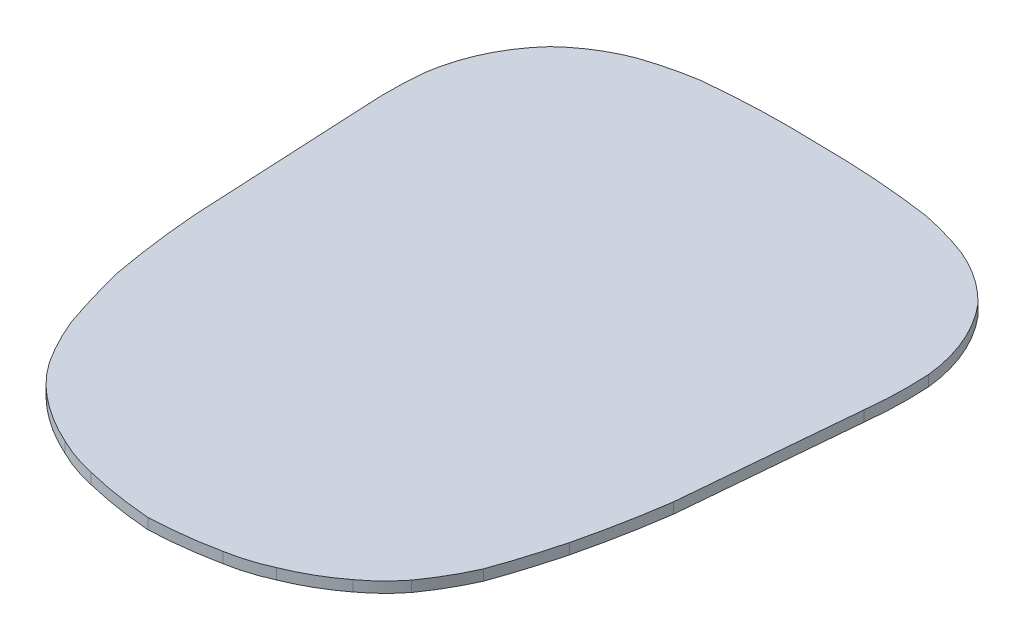
ISO-10303-21;
HEADER;
FILE_DESCRIPTION(('STEP AP214'),'2;1');
FILE_NAME('part.step','',(''),(''),'','','');
FILE_SCHEMA(('AUTOMOTIVE_DESIGN { 1 0 10303 214 1 1 1 1 }'));
ENDSEC;
DATA;
#1=APPLICATION_CONTEXT('core data for automotive mechanical design processes');
#2=APPLICATION_PROTOCOL_DEFINITION('international standard','automotive_design',2000,#1);
#3=PRODUCT_CONTEXT('',#1,'mechanical');
#4=PRODUCT('Part','Part','',(#3));
#5=PRODUCT_RELATED_PRODUCT_CATEGORY('part','',(#4));
#6=PRODUCT_DEFINITION_FORMATION('','',#4);
#7=PRODUCT_DEFINITION_CONTEXT('part definition',#1,'design');
#8=PRODUCT_DEFINITION('design','',#6,#7);
#9=PRODUCT_DEFINITION_SHAPE('','',#8);
#10=(LENGTH_UNIT() NAMED_UNIT(*) SI_UNIT(.MILLI.,.METRE.));
#11=(NAMED_UNIT(*) PLANE_ANGLE_UNIT() SI_UNIT($,.RADIAN.));
#12=(NAMED_UNIT(*) SI_UNIT($,.STERADIAN.) SOLID_ANGLE_UNIT());
#13=UNCERTAINTY_MEASURE_WITH_UNIT(LENGTH_MEASURE(1.E-05),#10,'distance_accuracy_value','');
#14=(GEOMETRIC_REPRESENTATION_CONTEXT(3) GLOBAL_UNCERTAINTY_ASSIGNED_CONTEXT((#13)) GLOBAL_UNIT_ASSIGNED_CONTEXT((#10,
#11,#12)) REPRESENTATION_CONTEXT('',''));
#15=CARTESIAN_POINT('',(0.,0.,0.));
#16=DIRECTION('',(0.,0.,1.));
#17=DIRECTION('',(1.,0.,0.));
#18=AXIS2_PLACEMENT_3D('',#15,#16,#17);
#19=CARTESIAN_POINT('',(-1.57240860866976,2.26760732929248,56.7680888848849));
#20=DIRECTION('',(0.,1.,0.));
#21=DIRECTION('',(1.,0.,0.));
#22=AXIS2_PLACEMENT_3D('',#19,#20,#21);
#23=PLANE('',#22);
#24=CARTESIAN_POINT('',(4.42207857906232,2.26760732929224,26.1060065080088));
#25=DIRECTION('',(0.,-1.,0.));
#26=DIRECTION('',(-1.,0.,0.));
#27=AXIS2_PLACEMENT_3D('',#24,#25,#26);
#28=CIRCLE('',#27,7.3740595978);
#29=CARTESIAN_POINT('',(11.7593440485898,2.26760732929246,25.3702821155991));
#30=VERTEX_POINT('',#29);
#31=CARTESIAN_POINT('',(10.0538039694728,2.26760732929235,21.3457098703074));
#32=VERTEX_POINT('',#31);
#33=EDGE_CURVE('E301',#30,#32,#28,.F.);
#34=ORIENTED_EDGE('',*,*,#33,.F.);
#35=CARTESIAN_POINT('',(-5.02148164229055,2.26760732929194,26.3930993028762));
#36=DIRECTION('',(0.,-1.,0.));
#37=DIRECTION('',(-1.,0.,0.));
#38=AXIS2_PLACEMENT_3D('',#35,#36,#37);
#39=CIRCLE('',#38,16.81196793556);
#40=CARTESIAN_POINT('',(11.6806465076377,2.2676073292925,28.3117397407053));
#41=VERTEX_POINT('',#40);
#42=EDGE_CURVE('E304',#41,#30,#39,.F.);
#43=ORIENTED_EDGE('',*,*,#42,.F.);
#44=DIRECTION('',(-0.0886995040357044,0.,0.996058431008854));
#45=VECTOR('',#44,1.);
#46=CARTESIAN_POINT('',(11.6806465076377,2.26760732929251,28.3117397407053));
#47=LINE('',#46,#45);
#48=CARTESIAN_POINT('',(10.9521530708852,2.26760732929253,36.4924171582455));
#49=VERTEX_POINT('',#48);
#50=EDGE_CURVE('E195',#41,#49,#47,.T.);
#51=ORIENTED_EDGE('',*,*,#50,.T.);
#52=CARTESIAN_POINT('',(-29.9774053404907,2.2676073292912,30.7359674961748));
#53=DIRECTION('',(0.,-1.,0.));
#54=DIRECTION('',(-1.,0.,0.));
#55=AXIS2_PLACEMENT_3D('',#52,#53,#54);
#56=CIRCLE('',#55,41.33237791928);
#57=CARTESIAN_POINT('',(10.168074425755,2.26760732929264,40.5698842540158));
#58=VERTEX_POINT('',#57);
#59=EDGE_CURVE('E20',#58,#49,#56,.F.);
#60=ORIENTED_EDGE('',*,*,#59,.F.);
#61=CARTESIAN_POINT('',(-23.6697185475926,2.26760732929142,31.8539569853536));
#62=DIRECTION('',(0.,-1.,0.));
#63=DIRECTION('',(-1.,0.,0.));
#64=AXIS2_PLACEMENT_3D('',#61,#62,#63);
#65=CIRCLE('',#64,34.94228987144);
#66=CARTESIAN_POINT('',(9.22351885768027,2.26760732929264,43.6437218031987));
#67=VERTEX_POINT('',#66);
#68=EDGE_CURVE('E193',#67,#58,#65,.F.);
#69=ORIENTED_EDGE('',*,*,#68,.F.);
#70=CARTESIAN_POINT('',(-2.27662830007259,2.2676073292922,38.4722908655236));
#71=DIRECTION('',(0.,-1.,0.));
#72=DIRECTION('',(-1.,0.,0.));
#73=AXIS2_PLACEMENT_3D('',#70,#71,#72);
#74=CIRCLE('',#73,12.60940452968);
#75=CARTESIAN_POINT('',(8.00180890675191,2.26760732929263,45.7764548271608));
#76=VERTEX_POINT('',#75);
#77=EDGE_CURVE('E206',#76,#67,#74,.F.);
#78=ORIENTED_EDGE('',*,*,#77,.F.);
#79=CARTESIAN_POINT('',(2.40671094314183,2.26760732929239,41.4066557836026));
#80=DIRECTION('',(0.,-1.,0.));
#81=DIRECTION('',(-1.,0.,0.));
#82=AXIS2_PLACEMENT_3D('',#79,#80,#81);
#83=CIRCLE('',#82,7.09931439672);
#84=CARTESIAN_POINT('',(6.60488205735902,2.26760732929261,47.1316557136662));
#85=VERTEX_POINT('',#84);
#86=EDGE_CURVE('E224',#85,#76,#83,.F.);
#87=ORIENTED_EDGE('',*,*,#86,.F.);
#88=CARTESIAN_POINT('',(0.665319016808594,2.26760732929231,39.3768483498174));
#89=DIRECTION('',(0.,-1.,0.));
#90=DIRECTION('',(-1.,0.,0.));
#91=AXIS2_PLACEMENT_3D('',#88,#89,#90);
#92=CIRCLE('',#91,9.76808304444);
#93=CARTESIAN_POINT('',(4.32729672971727,2.26760732929255,48.4325297484332));
#94=VERTEX_POINT('',#93);
#95=EDGE_CURVE('E227',#94,#85,#92,.F.);
#96=ORIENTED_EDGE('',*,*,#95,.F.);
#97=CARTESIAN_POINT('',(1.0962715162023,2.26760732929235,41.3746398254039));
#98=DIRECTION('',(0.,-1.,0.));
#99=DIRECTION('',(-1.,0.,0.));
#100=AXIS2_PLACEMENT_3D('',#97,#98,#99);
#101=CIRCLE('',#100,7.76230211316);
#102=CARTESIAN_POINT('',(2.4216958973115,2.2676073292925,49.0229458016269));
#103=VERTEX_POINT('',#102);
#104=EDGE_CURVE('E231',#103,#94,#101,.F.);
#105=ORIENTED_EDGE('',*,*,#104,.F.);
#106=CARTESIAN_POINT('',(-1.50562705310546,2.2676073292921,29.7823019466604));
#107=DIRECTION('',(0.,-1.,0.));
#108=DIRECTION('',(-1.,0.,0.));
#109=AXIS2_PLACEMENT_3D('',#106,#107,#108);
#110=CIRCLE('',#109,19.6373684976);
#111=CARTESIAN_POINT('',(-0.711226246908648,2.2676073292924,49.403595708022));
#112=VERTEX_POINT('',#111);
#113=EDGE_CURVE('E235',#112,#103,#110,.F.);
#114=ORIENTED_EDGE('',*,*,#113,.F.);
#115=CARTESIAN_POINT('',(0.780834496719865,2.26760732929217,29.8233057086877));
#116=DIRECTION('',(0.,-1.,0.));
#117=DIRECTION('',(-1.,0.,0.));
#118=AXIS2_PLACEMENT_3D('',#115,#116,#117);
#119=CIRCLE('',#118,19.63705684976);
#120=CARTESIAN_POINT('',(-3.87229574569521,2.2676073292923,48.9011038171653));
#121=VERTEX_POINT('',#120);
#122=EDGE_CURVE('E239',#121,#112,#119,.F.);
#123=ORIENTED_EDGE('',*,*,#122,.F.);
#124=CARTESIAN_POINT('',(-2.25185647870508,2.26760732929224,41.3098252240715));
#125=DIRECTION('',(0.,-1.,0.));
#126=DIRECTION('',(-1.,0.,0.));
#127=AXIS2_PLACEMENT_3D('',#124,#125,#126);
#128=CIRCLE('',#127,7.76230211316);
#129=CARTESIAN_POINT('',(-5.75361833776036,2.26760732929224,48.2373787589374));
#130=VERTEX_POINT('',#129);
#131=EDGE_CURVE('E243',#130,#121,#128,.F.);
#132=ORIENTED_EDGE('',*,*,#131,.F.);
#133=CARTESIAN_POINT('',(-1.74390750050726,2.26760732929222,39.3302094350337));
#134=DIRECTION('',(0.,-1.,0.));
#135=DIRECTION('',(-1.,0.,0.));
#136=AXIS2_PLACEMENT_3D('',#133,#134,#135);
#137=CIRCLE('',#136,9.76808304444);
#138=CARTESIAN_POINT('',(-7.97915028682764,2.26760732929213,46.8493313092099));
#139=VERTEX_POINT('',#138);
#140=EDGE_CURVE('E247',#139,#130,#137,.F.);
#141=ORIENTED_EDGE('',*,*,#140,.F.);
#142=CARTESIAN_POINT('',(-3.45763258069546,2.2676073292922,41.3761108188031));
#143=DIRECTION('',(0.,-1.,0.));
#144=DIRECTION('',(-1.,0.,0.));
#145=AXIS2_PLACEMENT_3D('',#142,#143,#144);
#146=CIRCLE('',#145,7.09931439672);
#147=CARTESIAN_POINT('',(-9.27735431255493,2.26760732929207,45.4419568398913));
#148=VERTEX_POINT('',#147);
#149=EDGE_CURVE('E251',#148,#139,#146,.F.);
#150=ORIENTED_EDGE('',*,*,#149,.F.);
#151=CARTESIAN_POINT('',(1.27607088396156,2.26760732929232,38.5410656500054));
#152=DIRECTION('',(0.,-1.,0.));
#153=DIRECTION('',(-1.,0.,0.));
#154=AXIS2_PLACEMENT_3D('',#151,#152,#153);
#155=CIRCLE('',#154,12.60940452968);
#156=CARTESIAN_POINT('',(-10.4156070143635,2.26760732929201,43.2635385736895));
#157=VERTEX_POINT('',#156);
#158=EDGE_CURVE('E255',#157,#148,#155,.F.);
#159=ORIENTED_EDGE('',*,*,#158,.F.);
#160=CARTESIAN_POINT('',(22.6114523086671,2.2676073292929,31.8540261418302));
#161=DIRECTION('',(0.,-1.,0.));
#162=DIRECTION('',(-1.,0.,0.));
#163=AXIS2_PLACEMENT_3D('',#160,#161,#162);
#164=CIRCLE('',#163,34.94228987144);
#165=CARTESIAN_POINT('',(-11.3308378537232,2.26760732929193,40.1536984240255));
#166=VERTEX_POINT('',#165);
#167=EDGE_CURVE('E259',#166,#157,#164,.F.);
#168=ORIENTED_EDGE('',*,*,#167,.F.);
#169=CARTESIAN_POINT('',(29.3351155793448,2.26760732929313,32.7614257124888));
#170=DIRECTION('',(0.,-1.,0.));
#171=DIRECTION('',(-1.,0.,0.));
#172=AXIS2_PLACEMENT_3D('',#169,#170,#171);
#173=CIRCLE('',#172,41.33237791928);
#174=CARTESIAN_POINT('',(-11.8661733347099,2.26760732929185,36.0506895028808));
#175=VERTEX_POINT('',#174);
#176=EDGE_CURVE('E263',#175,#166,#173,.F.);
#177=ORIENTED_EDGE('',*,*,#176,.F.);
#178=DIRECTION('',(-0.0500831809567765,0.,-0.998745050042928));
#179=VECTOR('',#178,1.);
#180=CARTESIAN_POINT('',(-11.8661733347099,2.26760732929186,36.0506895028803));
#181=LINE('',#180,#179);
#182=CARTESIAN_POINT('',(-12.2775089900255,2.2676073292918,27.8479467496358));
#183=VERTEX_POINT('',#182);
#184=EDGE_CURVE('E271',#175,#183,#181,.T.);
#185=ORIENTED_EDGE('',*,*,#184,.T.);
#186=CARTESIAN_POINT('',(4.48636162568622,2.26760732929224,26.5771565049552));
#187=DIRECTION('',(0.,-1.,0.));
#188=DIRECTION('',(-1.,0.,0.));
#189=AXIS2_PLACEMENT_3D('',#186,#187,#188);
#190=CIRCLE('',#189,16.81196793556);
#191=CARTESIAN_POINT('',(-12.2423060527561,2.26760732929168,24.9056471359908));
#192=VERTEX_POINT('',#191);
#193=EDGE_CURVE('E267',#192,#183,#190,.F.);
#194=ORIENTED_EDGE('',*,*,#193,.F.);
#195=CARTESIAN_POINT('',(-4.93901211459901,2.26760732929193,25.9247902097462));
#196=DIRECTION('',(0.,-1.,0.));
#197=DIRECTION('',(-1.,0.,0.));
#198=AXIS2_PLACEMENT_3D('',#195,#196,#197);
#199=CIRCLE('',#198,7.3740595978);
#200=CARTESIAN_POINT('',(-10.3822831278822,2.26760732929168,20.9500986989229));
#201=VERTEX_POINT('',#200);
#202=EDGE_CURVE('E273',#201,#192,#199,.F.);
#203=ORIENTED_EDGE('',*,*,#202,.F.);
#204=CARTESIAN_POINT('',(-5.24273193998348,2.26760732929193,26.3246247690595));
#205=DIRECTION('',(0.,-1.,0.));
#206=DIRECTION('',(-1.,0.,0.));
#207=AXIS2_PLACEMENT_3D('',#204,#205,#206);
#208=CIRCLE('',#207,7.43643173112);
#209=CARTESIAN_POINT('',(-7.86404338634419,2.26760732929175,19.3655125273445));
#210=VERTEX_POINT('',#209);
#211=EDGE_CURVE('E277',#210,#201,#208,.F.);
#212=ORIENTED_EDGE('',*,*,#211,.F.);
#213=CARTESIAN_POINT('',(-3.13266364538468,2.2676073292921,33.5130256945662));
#214=DIRECTION('',(0.,-1.,0.));
#215=DIRECTION('',(-1.,0.,0.));
#216=AXIS2_PLACEMENT_3D('',#213,#214,#215);
#217=CIRCLE('',#216,14.91771038296);
#218=CARTESIAN_POINT('',(-5.49599442515238,2.26760732929182,18.7837096651209));
#219=VERTEX_POINT('',#218);
#220=EDGE_CURVE('E281',#219,#210,#217,.F.);
#221=ORIENTED_EDGE('',*,*,#220,.F.);
#222=CARTESIAN_POINT('',(-1.57240860866976,2.26760732929248,56.7680888848849));
#223=DIRECTION('',(0.,-1.,0.));
#224=DIRECTION('',(-1.,0.,0.));
#225=AXIS2_PLACEMENT_3D('',#222,#223,#224);
#226=CIRCLE('',#225,38.18648439396);
#227=CARTESIAN_POINT('',(-0.115098477137718,2.26760732929199,18.6094222736066));
#228=VERTEX_POINT('',#227);
#229=EDGE_CURVE('E285',#228,#219,#226,.F.);
#230=ORIENTED_EDGE('',*,*,#229,.F.);
#231=CARTESIAN_POINT('',(-0.135712780641645,2.26760732929253,56.7959011448422));
#232=DIRECTION('',(0.,-1.,0.));
#233=DIRECTION('',(-1.,0.,0.));
#234=AXIS2_PLACEMENT_3D('',#231,#232,#233);
#235=CIRCLE('',#234,38.186484435371);
#236=CARTESIAN_POINT('',(5.25502065738708,2.26760732929216,18.9918327588477));
#237=VERTEX_POINT('',#236);
#238=EDGE_CURVE('E289',#237,#228,#235,.F.);
#239=ORIENTED_EDGE('',*,*,#238,.F.);
#240=CARTESIAN_POINT('',(2.32340041465556,2.26760732929227,33.6186466915632));
#241=DIRECTION('',(0.,-1.,0.));
#242=DIRECTION('',(-1.,0.,0.));
#243=AXIS2_PLACEMENT_3D('',#240,#241,#242);
#244=CIRCLE('',#243,14.91771038296);
#245=CARTESIAN_POINT('',(7.59877825453707,2.26760732929225,19.6648489391103));
#246=VERTEX_POINT('',#245);
#247=EDGE_CURVE('E293',#246,#237,#244,.F.);
#248=ORIENTED_EDGE('',*,*,#247,.F.);
#249=CARTESIAN_POINT('',(4.71009628830584,2.26760732929225,26.5172961946227));
#250=DIRECTION('',(0.,-1.,0.));
#251=DIRECTION('',(-1.,0.,0.));
#252=AXIS2_PLACEMENT_3D('',#249,#250,#251);
#253=CIRCLE('',#252,7.43643173111999);
#254=EDGE_CURVE('E297',#32,#246,#253,.F.);
#255=ORIENTED_EDGE('',*,*,#254,.F.);
#256=EDGE_LOOP('',(#34,#43,#51,#60,#69,#78,#87,#96,#105,#114,#123,#132,#141,#150,#159,#168,#177,
#185,#194,#203,#212,#221,#230,#239,#248,#255));
#257=FACE_BOUND('',#256,.T.);
#258=ADVANCED_FACE('F17',(#257),#23,.F.);
#259=CARTESIAN_POINT('',(-29.9774053404907,2.6486073292912,30.7359674961748));
#260=DIRECTION('',(0.,-1.,0.));
#261=DIRECTION('',(-1.,0.,0.));
#262=AXIS2_PLACEMENT_3D('',#259,#260,#261);
#263=CYLINDRICAL_SURFACE('',#262,41.33237791928);
#264=DIRECTION('',(0.,-1.,0.));
#265=VECTOR('',#264,1.);
#266=CARTESIAN_POINT('',(10.1680744257549,2.64860732929262,40.5698842540162));
#267=LINE('',#266,#265);
#268=CARTESIAN_POINT('',(10.1680744257549,2.76860732929264,40.5698842540159));
#269=VERTEX_POINT('',#268);
#270=EDGE_CURVE('E200',#58,#269,#267,.F.);
#271=ORIENTED_EDGE('',*,*,#270,.F.);
#272=ORIENTED_EDGE('',*,*,#59,.T.);
#273=DIRECTION('',(0.,1.,0.));
#274=VECTOR('',#273,1.);
#275=CARTESIAN_POINT('',(10.9521530708852,2.6486073292925,36.4924171582455));
#276=LINE('',#275,#274);
#277=CARTESIAN_POINT('',(10.9521530708852,2.76860732929259,36.4924171582455));
#278=VERTEX_POINT('',#277);
#279=EDGE_CURVE('E314',#49,#278,#276,.T.);
#280=ORIENTED_EDGE('',*,*,#279,.T.);
#281=CARTESIAN_POINT('',(-29.9774053404907,2.76860732929121,30.7359674961748));
#282=DIRECTION('',(0.,-1.,0.));
#283=DIRECTION('',(-1.,0.,0.));
#284=AXIS2_PLACEMENT_3D('',#281,#282,#283);
#285=CIRCLE('',#284,41.33237791928);
#286=EDGE_CURVE('E203',#269,#278,#285,.F.);
#287=ORIENTED_EDGE('',*,*,#286,.F.);
#288=EDGE_LOOP('',(#271,#272,#280,#287));
#289=FACE_BOUND('',#288,.T.);
#290=ADVANCED_FACE('F201',(#289),#263,.T.);
#291=CARTESIAN_POINT('',(11.6806465076376,2.6486073292925,28.3117397407053));
#292=DIRECTION('',(-0.996058431008854,0.,-0.0886995040357044));
#293=DIRECTION('',(-0.0886995040357044,0.,0.996058431008854));
#294=AXIS2_PLACEMENT_3D('',#291,#292,#293);
#295=PLANE('',#294);
#296=ORIENTED_EDGE('',*,*,#50,.F.);
#297=DIRECTION('',(0.,-1.,0.));
#298=VECTOR('',#297,1.);
#299=CARTESIAN_POINT('',(11.6806465076377,2.6486073292925,28.3117397407053));
#300=LINE('',#299,#298);
#301=CARTESIAN_POINT('',(11.6806465076376,2.76860732929251,28.3117397407053));
#302=VERTEX_POINT('',#301);
#303=EDGE_CURVE('E306',#302,#41,#300,.T.);
#304=ORIENTED_EDGE('',*,*,#303,.F.);
#305=DIRECTION('',(0.088699504035705,0.,-0.996058431008854));
#306=VECTOR('',#305,1.);
#307=CARTESIAN_POINT('',(10.9521530708852,2.7686073292926,36.4924171582455));
#308=LINE('',#307,#306);
#309=EDGE_CURVE('E215',#278,#302,#308,.T.);
#310=ORIENTED_EDGE('',*,*,#309,.F.);
#311=ORIENTED_EDGE('',*,*,#279,.F.);
#312=EDGE_LOOP('',(#296,#304,#310,#311));
#313=FACE_BOUND('',#312,.T.);
#314=ADVANCED_FACE('F583',(#313),#295,.F.);
#315=CARTESIAN_POINT('',(-5.02148164229056,2.64860732929194,26.3930993028762));
#316=DIRECTION('',(0.,-1.,0.));
#317=DIRECTION('',(-1.,0.,0.));
#318=AXIS2_PLACEMENT_3D('',#315,#316,#317);
#319=CYLINDRICAL_SURFACE('',#318,16.81196793556);
#320=ORIENTED_EDGE('',*,*,#303,.T.);
#321=ORIENTED_EDGE('',*,*,#42,.T.);
#322=DIRECTION('',(0.,-1.,0.));
#323=VECTOR('',#322,1.);
#324=CARTESIAN_POINT('',(11.7593440485897,2.64860732929246,25.3702821155991));
#325=LINE('',#324,#323);
#326=CARTESIAN_POINT('',(11.7593440485897,2.76860732929247,25.3702821155991));
#327=VERTEX_POINT('',#326);
#328=EDGE_CURVE('E303',#327,#30,#325,.T.);
#329=ORIENTED_EDGE('',*,*,#328,.F.);
#330=CARTESIAN_POINT('',(-5.02148164229056,2.76860732929194,26.3930993028762));
#331=DIRECTION('',(0.,-1.,0.));
#332=DIRECTION('',(-1.,0.,0.));
#333=AXIS2_PLACEMENT_3D('',#330,#331,#332);
#334=CIRCLE('',#333,16.81196793556);
#335=EDGE_CURVE('E407',#302,#327,#334,.F.);
#336=ORIENTED_EDGE('',*,*,#335,.F.);
#337=EDGE_LOOP('',(#320,#321,#329,#336));
#338=FACE_BOUND('',#337,.T.);
#339=ADVANCED_FACE('F580',(#338),#319,.T.);
#340=CARTESIAN_POINT('',(4.42207857906231,2.64860732929223,26.1060065080088));
#341=DIRECTION('',(0.,-1.,0.));
#342=DIRECTION('',(-1.,0.,0.));
#343=AXIS2_PLACEMENT_3D('',#340,#341,#342);
#344=CYLINDRICAL_SURFACE('',#343,7.3740595978);
#345=ORIENTED_EDGE('',*,*,#328,.T.);
#346=ORIENTED_EDGE('',*,*,#33,.T.);
#347=DIRECTION('',(0.,-1.,0.));
#348=VECTOR('',#347,1.);
#349=CARTESIAN_POINT('',(10.0538039694728,2.64860732929235,21.3457098703074));
#350=LINE('',#349,#348);
#351=CARTESIAN_POINT('',(10.0538039694728,2.76860732929237,21.3457098703074));
#352=VERTEX_POINT('',#351);
#353=EDGE_CURVE('E300',#352,#32,#350,.T.);
#354=ORIENTED_EDGE('',*,*,#353,.F.);
#355=CARTESIAN_POINT('',(4.42207857906231,2.76860732929225,26.1060065080088));
#356=DIRECTION('',(0.,-1.,0.));
#357=DIRECTION('',(-1.,0.,0.));
#358=AXIS2_PLACEMENT_3D('',#355,#356,#357);
#359=CIRCLE('',#358,7.3740595978);
#360=EDGE_CURVE('E404',#327,#352,#359,.F.);
#361=ORIENTED_EDGE('',*,*,#360,.F.);
#362=EDGE_LOOP('',(#345,#346,#354,#361));
#363=FACE_BOUND('',#362,.T.);
#364=ADVANCED_FACE('F484',(#363),#344,.T.);
#365=CARTESIAN_POINT('',(4.71009628830582,2.64860732929225,26.5172961946227));
#366=DIRECTION('',(0.,-1.,0.));
#367=DIRECTION('',(-1.,0.,0.));
#368=AXIS2_PLACEMENT_3D('',#365,#366,#367);
#369=CYLINDRICAL_SURFACE('',#368,7.43643173111999);
#370=ORIENTED_EDGE('',*,*,#353,.T.);
#371=ORIENTED_EDGE('',*,*,#254,.T.);
#372=DIRECTION('',(0.,-1.,0.));
#373=VECTOR('',#372,1.);
#374=CARTESIAN_POINT('',(7.59877825453708,2.64860732929225,19.6648489391103));
#375=LINE('',#374,#373);
#376=CARTESIAN_POINT('',(7.59877825453705,2.76860732929226,19.6648489391103));
#377=VERTEX_POINT('',#376);
#378=EDGE_CURVE('E296',#377,#246,#375,.T.);
#379=ORIENTED_EDGE('',*,*,#378,.F.);
#380=CARTESIAN_POINT('',(4.71009628830582,2.76860732929226,26.5172961946227));
#381=DIRECTION('',(0.,-1.,0.));
#382=DIRECTION('',(-1.,0.,0.));
#383=AXIS2_PLACEMENT_3D('',#380,#381,#382);
#384=CIRCLE('',#383,7.43643173111999);
#385=EDGE_CURVE('E400',#352,#377,#384,.F.);
#386=ORIENTED_EDGE('',*,*,#385,.F.);
#387=EDGE_LOOP('',(#370,#371,#379,#386));
#388=FACE_BOUND('',#387,.T.);
#389=ADVANCED_FACE('F479',(#388),#369,.T.);
#390=CARTESIAN_POINT('',(2.32340041465555,2.64860732929228,33.6186466915632));
#391=DIRECTION('',(0.,-1.,0.));
#392=DIRECTION('',(-1.,0.,0.));
#393=AXIS2_PLACEMENT_3D('',#390,#391,#392);
#394=CYLINDRICAL_SURFACE('',#393,14.91771038296);
#395=ORIENTED_EDGE('',*,*,#378,.T.);
#396=ORIENTED_EDGE('',*,*,#247,.T.);
#397=DIRECTION('',(0.,-1.,0.));
#398=VECTOR('',#397,1.);
#399=CARTESIAN_POINT('',(5.25502065738701,2.64860732929216,18.9918327588477));
#400=LINE('',#399,#398);
#401=CARTESIAN_POINT('',(5.25502065738708,2.76860732929217,18.9918327588477));
#402=VERTEX_POINT('',#401);
#403=EDGE_CURVE('E292',#402,#237,#400,.T.);
#404=ORIENTED_EDGE('',*,*,#403,.F.);
#405=CARTESIAN_POINT('',(2.32340041465554,2.76860732929228,33.6186466915632));
#406=DIRECTION('',(0.,-1.,0.));
#407=DIRECTION('',(-1.,0.,0.));
#408=AXIS2_PLACEMENT_3D('',#405,#406,#407);
#409=CIRCLE('',#408,14.91771038296);
#410=EDGE_CURVE('E396',#377,#402,#409,.F.);
#411=ORIENTED_EDGE('',*,*,#410,.F.);
#412=EDGE_LOOP('',(#395,#396,#404,#411));
#413=FACE_BOUND('',#412,.T.);
#414=ADVANCED_FACE('F489',(#413),#394,.T.);
#415=CARTESIAN_POINT('',(-0.135712780641657,2.64860732929253,56.7959011448422));
#416=DIRECTION('',(0.,-1.,0.));
#417=DIRECTION('',(-1.,0.,0.));
#418=AXIS2_PLACEMENT_3D('',#415,#416,#417);
#419=CYLINDRICAL_SURFACE('',#418,38.186484435371);
#420=ORIENTED_EDGE('',*,*,#403,.T.);
#421=ORIENTED_EDGE('',*,*,#238,.T.);
#422=DIRECTION('',(0.,-1.,0.));
#423=VECTOR('',#422,1.);
#424=CARTESIAN_POINT('',(-0.115098477137699,2.648607329292,18.6094222736066));
#425=LINE('',#424,#423);
#426=CARTESIAN_POINT('',(-0.115098477137734,2.76860732929199,18.6094222736066));
#427=VERTEX_POINT('',#426);
#428=EDGE_CURVE('E288',#427,#228,#425,.T.);
#429=ORIENTED_EDGE('',*,*,#428,.F.);
#430=CARTESIAN_POINT('',(-0.135712780641661,2.76860732929253,56.7959011448422));
#431=DIRECTION('',(0.,-1.,0.));
#432=DIRECTION('',(-1.,0.,0.));
#433=AXIS2_PLACEMENT_3D('',#430,#431,#432);
#434=CIRCLE('',#433,38.186484435371);
#435=EDGE_CURVE('E392',#402,#427,#434,.F.);
#436=ORIENTED_EDGE('',*,*,#435,.F.);
#437=EDGE_LOOP('',(#420,#421,#429,#436));
#438=FACE_BOUND('',#437,.T.);
#439=ADVANCED_FACE('F569',(#438),#419,.T.);
#440=CARTESIAN_POINT('',(-1.57240860866977,2.64860732929248,56.7680888848849));
#441=DIRECTION('',(0.,-1.,0.));
#442=DIRECTION('',(-1.,0.,0.));
#443=AXIS2_PLACEMENT_3D('',#440,#441,#442);
#444=CYLINDRICAL_SURFACE('',#443,38.18648439396);
#445=ORIENTED_EDGE('',*,*,#428,.T.);
#446=ORIENTED_EDGE('',*,*,#229,.T.);
#447=DIRECTION('',(0.,-1.,0.));
#448=VECTOR('',#447,1.);
#449=CARTESIAN_POINT('',(-5.49599442515232,2.64860732929181,18.7837096651209));
#450=LINE('',#449,#448);
#451=CARTESIAN_POINT('',(-5.49599442515241,2.76860732929182,18.7837096651209));
#452=VERTEX_POINT('',#451);
#453=EDGE_CURVE('E284',#452,#219,#450,.T.);
#454=ORIENTED_EDGE('',*,*,#453,.F.);
#455=CARTESIAN_POINT('',(-1.57240860866978,2.76860732929248,56.7680888848849));
#456=DIRECTION('',(0.,-1.,0.));
#457=DIRECTION('',(-1.,0.,0.));
#458=AXIS2_PLACEMENT_3D('',#455,#456,#457);
#459=CIRCLE('',#458,38.18648439396);
#460=EDGE_CURVE('E388',#427,#452,#459,.F.);
#461=ORIENTED_EDGE('',*,*,#460,.F.);
#462=EDGE_LOOP('',(#445,#446,#454,#461));
#463=FACE_BOUND('',#462,.T.);
#464=ADVANCED_FACE('F565',(#463),#444,.T.);
#465=CARTESIAN_POINT('',(-3.13266364538469,2.6486073292921,33.5130256945662));
#466=DIRECTION('',(0.,-1.,0.));
#467=DIRECTION('',(-1.,0.,0.));
#468=AXIS2_PLACEMENT_3D('',#465,#466,#467);
#469=CYLINDRICAL_SURFACE('',#468,14.91771038296);
#470=ORIENTED_EDGE('',*,*,#453,.T.);
#471=ORIENTED_EDGE('',*,*,#220,.T.);
#472=DIRECTION('',(0.,-1.,0.));
#473=VECTOR('',#472,1.);
#474=CARTESIAN_POINT('',(-7.86404338634418,2.64860732929175,19.3655125273445));
#475=LINE('',#474,#473);
#476=CARTESIAN_POINT('',(-7.86404338634421,2.76860732929176,19.3655125273445));
#477=VERTEX_POINT('',#476);
#478=EDGE_CURVE('E280',#477,#210,#475,.T.);
#479=ORIENTED_EDGE('',*,*,#478,.F.);
#480=CARTESIAN_POINT('',(-3.13266364538469,2.7686073292921,33.5130256945662));
#481=DIRECTION('',(0.,-1.,0.));
#482=DIRECTION('',(-1.,0.,0.));
#483=AXIS2_PLACEMENT_3D('',#480,#481,#482);
#484=CIRCLE('',#483,14.91771038296);
#485=EDGE_CURVE('E384',#452,#477,#484,.F.);
#486=ORIENTED_EDGE('',*,*,#485,.F.);
#487=EDGE_LOOP('',(#470,#471,#479,#486));
#488=FACE_BOUND('',#487,.T.);
#489=ADVANCED_FACE('F561',(#488),#469,.T.);
#490=CARTESIAN_POINT('',(-5.2427319399835,2.64860732929193,26.3246247690595));
#491=DIRECTION('',(0.,-1.,0.));
#492=DIRECTION('',(-1.,0.,0.));
#493=AXIS2_PLACEMENT_3D('',#490,#491,#492);
#494=CYLINDRICAL_SURFACE('',#493,7.43643173112);
#495=ORIENTED_EDGE('',*,*,#478,.T.);
#496=ORIENTED_EDGE('',*,*,#211,.T.);
#497=DIRECTION('',(0.,-1.,0.));
#498=VECTOR('',#497,1.);
#499=CARTESIAN_POINT('',(-10.3822831278822,2.64860732929169,20.9500986989229));
#500=LINE('',#499,#498);
#501=CARTESIAN_POINT('',(-10.3822831278822,2.7686073292917,20.9500986989229));
#502=VERTEX_POINT('',#501);
#503=EDGE_CURVE('E276',#502,#201,#500,.T.);
#504=ORIENTED_EDGE('',*,*,#503,.F.);
#505=CARTESIAN_POINT('',(-5.2427319399835,2.76860732929193,26.3246247690595));
#506=DIRECTION('',(0.,-1.,0.));
#507=DIRECTION('',(-1.,0.,0.));
#508=AXIS2_PLACEMENT_3D('',#505,#506,#507);
#509=CIRCLE('',#508,7.43643173112);
#510=EDGE_CURVE('E380',#477,#502,#509,.F.);
#511=ORIENTED_EDGE('',*,*,#510,.F.);
#512=EDGE_LOOP('',(#495,#496,#504,#511));
#513=FACE_BOUND('',#512,.T.);
#514=ADVANCED_FACE('F557',(#513),#494,.T.);
#515=CARTESIAN_POINT('',(-4.93901211459902,2.64860732929193,25.9247902097462));
#516=DIRECTION('',(0.,-1.,0.));
#517=DIRECTION('',(-1.,0.,0.));
#518=AXIS2_PLACEMENT_3D('',#515,#516,#517);
#519=CYLINDRICAL_SURFACE('',#518,7.3740595978);
#520=ORIENTED_EDGE('',*,*,#503,.T.);
#521=ORIENTED_EDGE('',*,*,#202,.T.);
#522=DIRECTION('',(0.,-1.,0.));
#523=VECTOR('',#522,1.);
#524=CARTESIAN_POINT('',(-12.2423060527561,2.64860732929169,24.9056471359908));
#525=LINE('',#524,#523);
#526=CARTESIAN_POINT('',(-12.2423060527562,2.7686073292917,24.9056471359908));
#527=VERTEX_POINT('',#526);
#528=EDGE_CURVE('E272',#527,#192,#525,.T.);
#529=ORIENTED_EDGE('',*,*,#528,.F.);
#530=CARTESIAN_POINT('',(-4.93901211459903,2.76860732929194,25.9247902097462));
#531=DIRECTION('',(0.,-1.,0.));
#532=DIRECTION('',(-1.,0.,0.));
#533=AXIS2_PLACEMENT_3D('',#530,#531,#532);
#534=CIRCLE('',#533,7.3740595978);
#535=EDGE_CURVE('E376',#502,#527,#534,.F.);
#536=ORIENTED_EDGE('',*,*,#535,.F.);
#537=EDGE_LOOP('',(#520,#521,#529,#536));
#538=FACE_BOUND('',#537,.T.);
#539=ADVANCED_FACE('F553',(#538),#519,.T.);
#540=CARTESIAN_POINT('',(4.4863616256862,2.64860732929224,26.5771565049552));
#541=DIRECTION('',(0.,-1.,0.));
#542=DIRECTION('',(-1.,0.,0.));
#543=AXIS2_PLACEMENT_3D('',#540,#541,#542);
#544=CYLINDRICAL_SURFACE('',#543,16.81196793556);
#545=ORIENTED_EDGE('',*,*,#528,.T.);
#546=ORIENTED_EDGE('',*,*,#193,.T.);
#547=DIRECTION('',(0.,1.,0.));
#548=VECTOR('',#547,1.);
#549=CARTESIAN_POINT('',(-12.2775089900255,2.64860732929185,27.8479467496357));
#550=LINE('',#549,#548);
#551=CARTESIAN_POINT('',(-12.2775089900255,2.76860732929173,27.8479467496358));
#552=VERTEX_POINT('',#551);
#553=EDGE_CURVE('E323',#183,#552,#550,.T.);
#554=ORIENTED_EDGE('',*,*,#553,.T.);
#555=CARTESIAN_POINT('',(4.4863616256862,2.76860732929224,26.5771565049552));
#556=DIRECTION('',(0.,-1.,0.));
#557=DIRECTION('',(-1.,0.,0.));
#558=AXIS2_PLACEMENT_3D('',#555,#556,#557);
#559=CIRCLE('',#558,16.81196793556);
#560=EDGE_CURVE('E372',#527,#552,#559,.F.);
#561=ORIENTED_EDGE('',*,*,#560,.F.);
#562=EDGE_LOOP('',(#545,#546,#554,#561));
#563=FACE_BOUND('',#562,.T.);
#564=ADVANCED_FACE('F549',(#563),#544,.T.);
#565=CARTESIAN_POINT('',(-11.8661733347099,2.64860732929185,36.0506895028803));
#566=DIRECTION('',(0.998745050042928,0.,-0.0500831809567765));
#567=DIRECTION('',(-0.0500831809567765,0.,-0.998745050042928));
#568=AXIS2_PLACEMENT_3D('',#565,#566,#567);
#569=PLANE('',#568);
#570=ORIENTED_EDGE('',*,*,#184,.F.);
#571=DIRECTION('',(0.,-1.,0.));
#572=VECTOR('',#571,1.);
#573=CARTESIAN_POINT('',(-11.8661733347099,2.64860732929185,36.0506895028805));
#574=LINE('',#573,#572);
#575=CARTESIAN_POINT('',(-11.8661733347099,2.76860732929187,36.0506895028806));
#576=VERTEX_POINT('',#575);
#577=EDGE_CURVE('E266',#576,#175,#574,.T.);
#578=ORIENTED_EDGE('',*,*,#577,.F.);
#579=DIRECTION('',(0.0500831809567763,0.,0.998745050042928));
#580=VECTOR('',#579,1.);
#581=CARTESIAN_POINT('',(-12.2775089900255,2.76860732929173,27.8479467496357));
#582=LINE('',#581,#580);
#583=EDGE_CURVE('E371',#552,#576,#582,.T.);
#584=ORIENTED_EDGE('',*,*,#583,.F.);
#585=ORIENTED_EDGE('',*,*,#553,.F.);
#586=EDGE_LOOP('',(#570,#578,#584,#585));
#587=FACE_BOUND('',#586,.T.);
#588=ADVANCED_FACE('F545',(#587),#569,.F.);
#589=CARTESIAN_POINT('',(29.3351155793448,2.64860732929312,32.7614257124888));
#590=DIRECTION('',(0.,-1.,0.));
#591=DIRECTION('',(-1.,0.,0.));
#592=AXIS2_PLACEMENT_3D('',#589,#590,#591);
#593=CYLINDRICAL_SURFACE('',#592,41.33237791928);
#594=ORIENTED_EDGE('',*,*,#577,.T.);
#595=ORIENTED_EDGE('',*,*,#176,.T.);
#596=DIRECTION('',(0.,-1.,0.));
#597=VECTOR('',#596,1.);
#598=CARTESIAN_POINT('',(-11.3308378537232,2.64860732929193,40.1536984240256));
#599=LINE('',#598,#597);
#600=CARTESIAN_POINT('',(-11.3308378537232,2.76860732929191,40.1536984240255));
#601=VERTEX_POINT('',#600);
#602=EDGE_CURVE('E262',#601,#166,#599,.T.);
#603=ORIENTED_EDGE('',*,*,#602,.F.);
#604=CARTESIAN_POINT('',(29.3351155793448,2.76860732929313,32.7614257124888));
#605=DIRECTION('',(0.,-1.,0.));
#606=DIRECTION('',(-1.,0.,0.));
#607=AXIS2_PLACEMENT_3D('',#604,#605,#606);
#608=CIRCLE('',#607,41.33237791928);
#609=EDGE_CURVE('E367',#576,#601,#608,.F.);
#610=ORIENTED_EDGE('',*,*,#609,.F.);
#611=EDGE_LOOP('',(#594,#595,#603,#610));
#612=FACE_BOUND('',#611,.T.);
#613=ADVANCED_FACE('F541',(#612),#593,.T.);
#614=CARTESIAN_POINT('',(22.6114523086671,2.64860732929289,31.8540261418302));
#615=DIRECTION('',(0.,-1.,0.));
#616=DIRECTION('',(-1.,0.,0.));
#617=AXIS2_PLACEMENT_3D('',#614,#615,#616);
#618=CYLINDRICAL_SURFACE('',#617,34.94228987144);
#619=ORIENTED_EDGE('',*,*,#602,.T.);
#620=ORIENTED_EDGE('',*,*,#167,.T.);
#621=DIRECTION('',(0.,-1.,0.));
#622=VECTOR('',#621,1.);
#623=CARTESIAN_POINT('',(-10.4156070143636,2.64860732929201,43.2635385736895));
#624=LINE('',#623,#622);
#625=CARTESIAN_POINT('',(-10.4156070143636,2.76860732929201,43.2635385736895));
#626=VERTEX_POINT('',#625);
#627=EDGE_CURVE('E258',#626,#157,#624,.T.);
#628=ORIENTED_EDGE('',*,*,#627,.F.);
#629=CARTESIAN_POINT('',(22.6114523086671,2.76860732929289,31.8540261418302));
#630=DIRECTION('',(0.,-1.,0.));
#631=DIRECTION('',(-1.,0.,0.));
#632=AXIS2_PLACEMENT_3D('',#629,#630,#631);
#633=CIRCLE('',#632,34.94228987144);
#634=EDGE_CURVE('E363',#601,#626,#633,.F.);
#635=ORIENTED_EDGE('',*,*,#634,.F.);
#636=EDGE_LOOP('',(#619,#620,#628,#635));
#637=FACE_BOUND('',#636,.T.);
#638=ADVANCED_FACE('F537',(#637),#618,.T.);
#639=CARTESIAN_POINT('',(1.27607088396155,2.64860732929231,38.5410656500054));
#640=DIRECTION('',(0.,-1.,0.));
#641=DIRECTION('',(-1.,0.,0.));
#642=AXIS2_PLACEMENT_3D('',#639,#640,#641);
#643=CYLINDRICAL_SURFACE('',#642,12.60940452968);
#644=ORIENTED_EDGE('',*,*,#627,.T.);
#645=ORIENTED_EDGE('',*,*,#158,.T.);
#646=DIRECTION('',(0.,-1.,0.));
#647=VECTOR('',#646,1.);
#648=CARTESIAN_POINT('',(-9.27735431255496,2.64860732929207,45.4419568398913));
#649=LINE('',#648,#647);
#650=CARTESIAN_POINT('',(-9.27735431255494,2.76860732929207,45.4419568398913));
#651=VERTEX_POINT('',#650);
#652=EDGE_CURVE('E254',#651,#148,#649,.T.);
#653=ORIENTED_EDGE('',*,*,#652,.F.);
#654=CARTESIAN_POINT('',(1.27607088396155,2.76860732929232,38.5410656500054));
#655=DIRECTION('',(0.,-1.,0.));
#656=DIRECTION('',(-1.,0.,0.));
#657=AXIS2_PLACEMENT_3D('',#654,#655,#656);
#658=CIRCLE('',#657,12.60940452968);
#659=EDGE_CURVE('E360',#626,#651,#658,.F.);
#660=ORIENTED_EDGE('',*,*,#659,.F.);
#661=EDGE_LOOP('',(#644,#645,#653,#660));
#662=FACE_BOUND('',#661,.T.);
#663=ADVANCED_FACE('F533',(#662),#643,.T.);
#664=CARTESIAN_POINT('',(-3.45763258069547,2.6486073292922,41.3761108188031));
#665=DIRECTION('',(0.,-1.,0.));
#666=DIRECTION('',(-1.,0.,0.));
#667=AXIS2_PLACEMENT_3D('',#664,#665,#666);
#668=CYLINDRICAL_SURFACE('',#667,7.09931439672);
#669=ORIENTED_EDGE('',*,*,#652,.T.);
#670=ORIENTED_EDGE('',*,*,#149,.T.);
#671=DIRECTION('',(0.,-1.,0.));
#672=VECTOR('',#671,1.);
#673=CARTESIAN_POINT('',(-7.9791502868278,2.64860732929214,46.8493313092098));
#674=LINE('',#673,#672);
#675=CARTESIAN_POINT('',(-7.97915028682771,2.76860732929214,46.8493313092099));
#676=VERTEX_POINT('',#675);
#677=EDGE_CURVE('E250',#676,#139,#674,.T.);
#678=ORIENTED_EDGE('',*,*,#677,.F.);
#679=CARTESIAN_POINT('',(-3.45763258069547,2.76860732929221,41.3761108188031));
#680=DIRECTION('',(0.,-1.,0.));
#681=DIRECTION('',(-1.,0.,0.));
#682=AXIS2_PLACEMENT_3D('',#679,#680,#681);
#683=CIRCLE('',#682,7.09931439672);
#684=EDGE_CURVE('E356',#651,#676,#683,.F.);
#685=ORIENTED_EDGE('',*,*,#684,.F.);
#686=EDGE_LOOP('',(#669,#670,#678,#685));
#687=FACE_BOUND('',#686,.T.);
#688=ADVANCED_FACE('F529',(#687),#668,.T.);
#689=CARTESIAN_POINT('',(-1.74390750050728,2.64860732929223,39.3302094350337));
#690=DIRECTION('',(0.,-1.,0.));
#691=DIRECTION('',(-1.,0.,0.));
#692=AXIS2_PLACEMENT_3D('',#689,#690,#691);
#693=CYLINDRICAL_SURFACE('',#692,9.76808304444);
#694=ORIENTED_EDGE('',*,*,#677,.T.);
#695=ORIENTED_EDGE('',*,*,#140,.T.);
#696=DIRECTION('',(0.,-1.,0.));
#697=VECTOR('',#696,1.);
#698=CARTESIAN_POINT('',(-5.75361833776038,2.64860732929222,48.2373787589374));
#699=LINE('',#698,#697);
#700=CARTESIAN_POINT('',(-5.75361833776038,2.76860732929223,48.2373787589374));
#701=VERTEX_POINT('',#700);
#702=EDGE_CURVE('E246',#701,#130,#699,.T.);
#703=ORIENTED_EDGE('',*,*,#702,.F.);
#704=CARTESIAN_POINT('',(-1.74390750050728,2.76860732929223,39.3302094350337));
#705=DIRECTION('',(0.,-1.,0.));
#706=DIRECTION('',(-1.,0.,0.));
#707=AXIS2_PLACEMENT_3D('',#704,#705,#706);
#708=CIRCLE('',#707,9.76808304444);
#709=EDGE_CURVE('E352',#676,#701,#708,.F.);
#710=ORIENTED_EDGE('',*,*,#709,.F.);
#711=EDGE_LOOP('',(#694,#695,#703,#710));
#712=FACE_BOUND('',#711,.T.);
#713=ADVANCED_FACE('F525',(#712),#693,.T.);
#714=CARTESIAN_POINT('',(-2.25185647870509,2.64860732929223,41.3098252240714));
#715=DIRECTION('',(0.,-1.,0.));
#716=DIRECTION('',(-1.,0.,0.));
#717=AXIS2_PLACEMENT_3D('',#714,#715,#716);
#718=CYLINDRICAL_SURFACE('',#717,7.76230211316);
#719=ORIENTED_EDGE('',*,*,#702,.T.);
#720=ORIENTED_EDGE('',*,*,#131,.T.);
#721=DIRECTION('',(0.,-1.,0.));
#722=VECTOR('',#721,1.);
#723=CARTESIAN_POINT('',(-3.87229574569507,2.64860732929231,48.9011038171653));
#724=LINE('',#723,#722);
#725=CARTESIAN_POINT('',(-3.87229574569524,2.7686073292923,48.9011038171653));
#726=VERTEX_POINT('',#725);
#727=EDGE_CURVE('E242',#726,#121,#724,.T.);
#728=ORIENTED_EDGE('',*,*,#727,.F.);
#729=CARTESIAN_POINT('',(-2.2518564787051,2.76860732929224,41.3098252240714));
#730=DIRECTION('',(0.,-1.,0.));
#731=DIRECTION('',(-1.,0.,0.));
#732=AXIS2_PLACEMENT_3D('',#729,#730,#731);
#733=CIRCLE('',#732,7.76230211316);
#734=EDGE_CURVE('E348',#701,#726,#733,.F.);
#735=ORIENTED_EDGE('',*,*,#734,.F.);
#736=EDGE_LOOP('',(#719,#720,#728,#735));
#737=FACE_BOUND('',#736,.T.);
#738=ADVANCED_FACE('F521',(#737),#718,.T.);
#739=CARTESIAN_POINT('',(0.780834496719853,2.64860732929218,29.8233057086877));
#740=DIRECTION('',(0.,-1.,0.));
#741=DIRECTION('',(-1.,0.,0.));
#742=AXIS2_PLACEMENT_3D('',#739,#740,#741);
#743=CYLINDRICAL_SURFACE('',#742,19.63705684976);
#744=ORIENTED_EDGE('',*,*,#727,.T.);
#745=ORIENTED_EDGE('',*,*,#122,.T.);
#746=DIRECTION('',(0.,-1.,0.));
#747=VECTOR('',#746,1.);
#748=CARTESIAN_POINT('',(-0.711226246908645,2.64860732929241,49.403595708022));
#749=LINE('',#748,#747);
#750=CARTESIAN_POINT('',(-0.711226246908664,2.76860732929241,49.403595708022));
#751=VERTEX_POINT('',#750);
#752=EDGE_CURVE('E238',#751,#112,#749,.T.);
#753=ORIENTED_EDGE('',*,*,#752,.F.);
#754=CARTESIAN_POINT('',(0.780834496719849,2.76860732929218,29.8233057086877));
#755=DIRECTION('',(0.,-1.,0.));
#756=DIRECTION('',(-1.,0.,0.));
#757=AXIS2_PLACEMENT_3D('',#754,#755,#756);
#758=CIRCLE('',#757,19.63705684976);
#759=EDGE_CURVE('E344',#726,#751,#758,.F.);
#760=ORIENTED_EDGE('',*,*,#759,.F.);
#761=EDGE_LOOP('',(#744,#745,#753,#760));
#762=FACE_BOUND('',#761,.T.);
#763=ADVANCED_FACE('F517',(#762),#743,.T.);
#764=CARTESIAN_POINT('',(-1.50562705310548,2.6486073292921,29.7823019466604));
#765=DIRECTION('',(0.,-1.,0.));
#766=DIRECTION('',(-1.,0.,0.));
#767=AXIS2_PLACEMENT_3D('',#764,#765,#766);
#768=CYLINDRICAL_SURFACE('',#767,19.6373684976);
#769=ORIENTED_EDGE('',*,*,#752,.T.);
#770=ORIENTED_EDGE('',*,*,#113,.T.);
#771=DIRECTION('',(0.,-1.,0.));
#772=VECTOR('',#771,1.);
#773=CARTESIAN_POINT('',(2.42169589731152,2.6486073292925,49.0229458016269));
#774=LINE('',#773,#772);
#775=CARTESIAN_POINT('',(2.42169589731147,2.7686073292925,49.0229458016269));
#776=VERTEX_POINT('',#775);
#777=EDGE_CURVE('E234',#776,#103,#774,.T.);
#778=ORIENTED_EDGE('',*,*,#777,.F.);
#779=CARTESIAN_POINT('',(-1.50562705310548,2.7686073292921,29.7823019466604));
#780=DIRECTION('',(0.,-1.,0.));
#781=DIRECTION('',(-1.,0.,0.));
#782=AXIS2_PLACEMENT_3D('',#779,#780,#781);
#783=CIRCLE('',#782,19.6373684976);
#784=EDGE_CURVE('E340',#751,#776,#783,.F.);
#785=ORIENTED_EDGE('',*,*,#784,.F.);
#786=EDGE_LOOP('',(#769,#770,#778,#785));
#787=FACE_BOUND('',#786,.T.);
#788=ADVANCED_FACE('F513',(#787),#768,.T.);
#789=CARTESIAN_POINT('',(1.09627151620229,2.64860732929235,41.3746398254039));
#790=DIRECTION('',(0.,-1.,0.));
#791=DIRECTION('',(-1.,0.,0.));
#792=AXIS2_PLACEMENT_3D('',#789,#790,#791);
#793=CYLINDRICAL_SURFACE('',#792,7.76230211316);
#794=ORIENTED_EDGE('',*,*,#777,.T.);
#795=ORIENTED_EDGE('',*,*,#104,.T.);
#796=DIRECTION('',(0.,-1.,0.));
#797=VECTOR('',#796,1.);
#798=CARTESIAN_POINT('',(4.32729672971722,2.64860732929255,48.4325297484332));
#799=LINE('',#798,#797);
#800=CARTESIAN_POINT('',(4.32729672971725,2.76860732929255,48.4325297484332));
#801=VERTEX_POINT('',#800);
#802=EDGE_CURVE('E230',#801,#94,#799,.T.);
#803=ORIENTED_EDGE('',*,*,#802,.F.);
#804=CARTESIAN_POINT('',(1.09627151620228,2.76860732929235,41.3746398254039));
#805=DIRECTION('',(0.,-1.,0.));
#806=DIRECTION('',(-1.,0.,0.));
#807=AXIS2_PLACEMENT_3D('',#804,#805,#806);
#808=CIRCLE('',#807,7.76230211316);
#809=EDGE_CURVE('E337',#776,#801,#808,.F.);
#810=ORIENTED_EDGE('',*,*,#809,.F.);
#811=EDGE_LOOP('',(#794,#795,#803,#810));
#812=FACE_BOUND('',#811,.T.);
#813=ADVANCED_FACE('F509',(#812),#793,.T.);
#814=CARTESIAN_POINT('',(0.665319016808582,2.64860732929231,39.3768483498174));
#815=DIRECTION('',(0.,-1.,0.));
#816=DIRECTION('',(-1.,0.,0.));
#817=AXIS2_PLACEMENT_3D('',#814,#815,#816);
#818=CYLINDRICAL_SURFACE('',#817,9.76808304444);
#819=ORIENTED_EDGE('',*,*,#802,.T.);
#820=ORIENTED_EDGE('',*,*,#95,.T.);
#821=DIRECTION('',(0.,-1.,0.));
#822=VECTOR('',#821,1.);
#823=CARTESIAN_POINT('',(6.60488205735906,2.6486073292926,47.1316557136661));
#824=LINE('',#823,#822);
#825=CARTESIAN_POINT('',(6.604882057359,2.7686073292926,47.1316557136662));
#826=VERTEX_POINT('',#825);
#827=EDGE_CURVE('E226',#826,#85,#824,.T.);
#828=ORIENTED_EDGE('',*,*,#827,.F.);
#829=CARTESIAN_POINT('',(0.665319016808578,2.76860732929231,39.3768483498174));
#830=DIRECTION('',(0.,-1.,0.));
#831=DIRECTION('',(-1.,0.,0.));
#832=AXIS2_PLACEMENT_3D('',#829,#830,#831);
#833=CIRCLE('',#832,9.76808304444);
#834=EDGE_CURVE('E333',#801,#826,#833,.F.);
#835=ORIENTED_EDGE('',*,*,#834,.F.);
#836=EDGE_LOOP('',(#819,#820,#828,#835));
#837=FACE_BOUND('',#836,.T.);
#838=ADVANCED_FACE('F505',(#837),#818,.T.);
#839=CARTESIAN_POINT('',(2.40671094314182,2.64860732929239,41.4066557836026));
#840=DIRECTION('',(0.,-1.,0.));
#841=DIRECTION('',(-1.,0.,0.));
#842=AXIS2_PLACEMENT_3D('',#839,#840,#841);
#843=CYLINDRICAL_SURFACE('',#842,7.09931439672);
#844=ORIENTED_EDGE('',*,*,#827,.T.);
#845=ORIENTED_EDGE('',*,*,#86,.T.);
#846=DIRECTION('',(0.,-1.,0.));
#847=VECTOR('',#846,1.);
#848=CARTESIAN_POINT('',(8.00180890675189,2.64860732929262,45.7764548271608));
#849=LINE('',#848,#847);
#850=CARTESIAN_POINT('',(8.00180890675189,2.76860732929262,45.7764548271608));
#851=VERTEX_POINT('',#850);
#852=EDGE_CURVE('E223',#851,#76,#849,.T.);
#853=ORIENTED_EDGE('',*,*,#852,.F.);
#854=CARTESIAN_POINT('',(2.40671094314181,2.76860732929239,41.4066557836026));
#855=DIRECTION('',(0.,-1.,0.));
#856=DIRECTION('',(-1.,0.,0.));
#857=AXIS2_PLACEMENT_3D('',#854,#855,#856);
#858=CIRCLE('',#857,7.09931439672);
#859=EDGE_CURVE('E329',#826,#851,#858,.F.);
#860=ORIENTED_EDGE('',*,*,#859,.F.);
#861=EDGE_LOOP('',(#844,#845,#853,#860));
#862=FACE_BOUND('',#861,.T.);
#863=ADVANCED_FACE('F502',(#862),#843,.T.);
#864=CARTESIAN_POINT('',(-2.27662830007261,2.6486073292922,38.4722908655236));
#865=DIRECTION('',(0.,-1.,0.));
#866=DIRECTION('',(-1.,0.,0.));
#867=AXIS2_PLACEMENT_3D('',#864,#865,#866);
#868=CYLINDRICAL_SURFACE('',#867,12.60940452968);
#869=ORIENTED_EDGE('',*,*,#852,.T.);
#870=ORIENTED_EDGE('',*,*,#77,.T.);
#871=DIRECTION('',(0.,-1.,0.));
#872=VECTOR('',#871,1.);
#873=CARTESIAN_POINT('',(9.22351885768026,2.64860732929264,43.6437218031987));
#874=LINE('',#873,#872);
#875=CARTESIAN_POINT('',(9.22351885768025,2.76860732929264,43.6437218031987));
#876=VERTEX_POINT('',#875);
#877=EDGE_CURVE('E36',#876,#67,#874,.T.);
#878=ORIENTED_EDGE('',*,*,#877,.F.);
#879=CARTESIAN_POINT('',(-2.27662830007261,2.76860732929221,38.4722908655236));
#880=DIRECTION('',(0.,-1.,0.));
#881=DIRECTION('',(-1.,0.,0.));
#882=AXIS2_PLACEMENT_3D('',#879,#880,#881);
#883=CIRCLE('',#882,12.60940452968);
#884=EDGE_CURVE('E27',#851,#876,#883,.F.);
#885=ORIENTED_EDGE('',*,*,#884,.F.);
#886=EDGE_LOOP('',(#869,#870,#878,#885));
#887=FACE_BOUND('',#886,.T.);
#888=ADVANCED_FACE('F497',(#887),#868,.T.);
#889=CARTESIAN_POINT('',(-23.6697185475926,2.64860732929142,31.8539569853536));
#890=DIRECTION('',(0.,-1.,0.));
#891=DIRECTION('',(-1.,0.,0.));
#892=AXIS2_PLACEMENT_3D('',#889,#890,#891);
#893=CYLINDRICAL_SURFACE('',#892,34.94228987144);
#894=ORIENTED_EDGE('',*,*,#877,.T.);
#895=ORIENTED_EDGE('',*,*,#68,.T.);
#896=ORIENTED_EDGE('',*,*,#270,.T.);
#897=CARTESIAN_POINT('',(-23.6697185475926,2.76860732929143,31.8539569853536));
#898=DIRECTION('',(0.,-1.,0.));
#899=DIRECTION('',(-1.,0.,0.));
#900=AXIS2_PLACEMENT_3D('',#897,#898,#899);
#901=CIRCLE('',#900,34.94228987144);
#902=EDGE_CURVE('E11',#876,#269,#901,.F.);
#903=ORIENTED_EDGE('',*,*,#902,.F.);
#904=EDGE_LOOP('',(#894,#895,#896,#903));
#905=FACE_BOUND('',#904,.T.);
#906=ADVANCED_FACE('F208',(#905),#893,.T.);
#907=CARTESIAN_POINT('',(4.71009628830582,2.76860732929226,26.5172961946227));
#908=DIRECTION('',(0.,1.,0.));
#909=DIRECTION('',(1.,0.,0.));
#910=AXIS2_PLACEMENT_3D('',#907,#908,#909);
#911=PLANE('',#910);
#912=ORIENTED_EDGE('',*,*,#884,.T.);
#913=ORIENTED_EDGE('',*,*,#902,.T.);
#914=ORIENTED_EDGE('',*,*,#286,.T.);
#915=ORIENTED_EDGE('',*,*,#309,.T.);
#916=ORIENTED_EDGE('',*,*,#335,.T.);
#917=ORIENTED_EDGE('',*,*,#360,.T.);
#918=ORIENTED_EDGE('',*,*,#385,.T.);
#919=ORIENTED_EDGE('',*,*,#410,.T.);
#920=ORIENTED_EDGE('',*,*,#435,.T.);
#921=ORIENTED_EDGE('',*,*,#460,.T.);
#922=ORIENTED_EDGE('',*,*,#485,.T.);
#923=ORIENTED_EDGE('',*,*,#510,.T.);
#924=ORIENTED_EDGE('',*,*,#535,.T.);
#925=ORIENTED_EDGE('',*,*,#560,.T.);
#926=ORIENTED_EDGE('',*,*,#583,.T.);
#927=ORIENTED_EDGE('',*,*,#609,.T.);
#928=ORIENTED_EDGE('',*,*,#634,.T.);
#929=ORIENTED_EDGE('',*,*,#659,.T.);
#930=ORIENTED_EDGE('',*,*,#684,.T.);
#931=ORIENTED_EDGE('',*,*,#709,.T.);
#932=ORIENTED_EDGE('',*,*,#734,.T.);
#933=ORIENTED_EDGE('',*,*,#759,.T.);
#934=ORIENTED_EDGE('',*,*,#784,.T.);
#935=ORIENTED_EDGE('',*,*,#809,.T.);
#936=ORIENTED_EDGE('',*,*,#834,.T.);
#937=ORIENTED_EDGE('',*,*,#859,.T.);
#938=EDGE_LOOP('',(#912,#913,#914,#915,#916,#917,#918,#919,#920,#921,#922,#923,#924,#925,#926,
#927,#928,#929,#930,#931,#932,#933,#934,#935,#936,#937));
#939=FACE_BOUND('',#938,.T.);
#940=ADVANCED_FACE('F491',(#939),#911,.T.);
#941=CLOSED_SHELL('',(#258,#290,#314,#339,#364,#389,#414,#439,#464,#489,#514,#539,#564,#588,
#613,#638,#663,#688,#713,#738,#763,#788,#813,#838,#863,#888,#906,#940));
#942=MANIFOLD_SOLID_BREP('B1',#941);
#943=ADVANCED_BREP_SHAPE_REPRESENTATION('',(#18,#942),#14);
#944=SHAPE_DEFINITION_REPRESENTATION(#9,#943);
ENDSEC;
END-ISO-10303-21;
